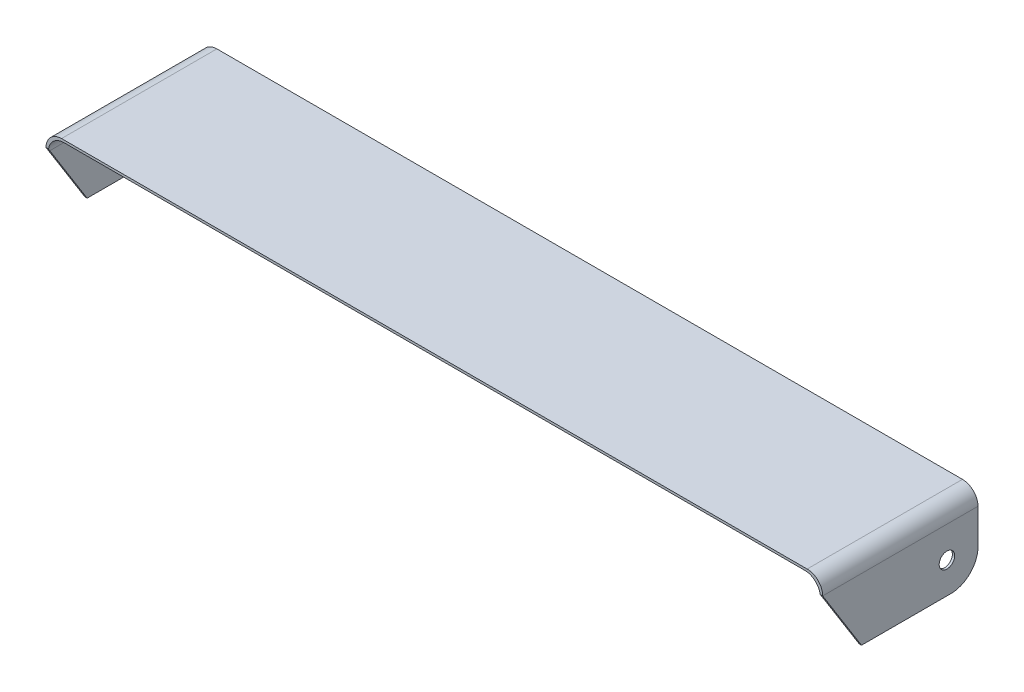
ISO-10303-21;
HEADER;
FILE_DESCRIPTION(('STEP AP214'),'2;1');
FILE_NAME('part.step','',(''),(''),'','','');
FILE_SCHEMA(('AUTOMOTIVE_DESIGN { 1 0 10303 214 1 1 1 1 }'));
ENDSEC;
DATA;
#1=APPLICATION_CONTEXT('core data for automotive mechanical design processes');
#2=APPLICATION_PROTOCOL_DEFINITION('international standard','automotive_design',2000,#1);
#3=PRODUCT_CONTEXT('',#1,'mechanical');
#4=PRODUCT('Part','Part','',(#3));
#5=PRODUCT_RELATED_PRODUCT_CATEGORY('part','',(#4));
#6=PRODUCT_DEFINITION_FORMATION('','',#4);
#7=PRODUCT_DEFINITION_CONTEXT('part definition',#1,'design');
#8=PRODUCT_DEFINITION('design','',#6,#7);
#9=PRODUCT_DEFINITION_SHAPE('','',#8);
#10=(LENGTH_UNIT() NAMED_UNIT(*) SI_UNIT(.MILLI.,.METRE.));
#11=(NAMED_UNIT(*) PLANE_ANGLE_UNIT() SI_UNIT($,.RADIAN.));
#12=(NAMED_UNIT(*) SI_UNIT($,.STERADIAN.) SOLID_ANGLE_UNIT());
#13=UNCERTAINTY_MEASURE_WITH_UNIT(LENGTH_MEASURE(1.E-05),#10,'distance_accuracy_value','');
#14=(GEOMETRIC_REPRESENTATION_CONTEXT(3) GLOBAL_UNCERTAINTY_ASSIGNED_CONTEXT((#13)) GLOBAL_UNIT_ASSIGNED_CONTEXT((#10,
#11,#12)) REPRESENTATION_CONTEXT('',''));
#15=CARTESIAN_POINT('',(0.,0.,0.));
#16=DIRECTION('',(0.,0.,1.));
#17=DIRECTION('',(1.,0.,0.));
#18=AXIS2_PLACEMENT_3D('',#15,#16,#17);
#19=CARTESIAN_POINT('',(0.,0.,100.));
#20=DIRECTION('',(0.,1.,0.));
#21=DIRECTION('',(0.,0.,1.));
#22=AXIS2_PLACEMENT_3D('',#19,#20,#21);
#23=PLANE('',#22);
#24=DIRECTION('',(0.,0.,-1.));
#25=VECTOR('',#24,1.);
#26=CARTESIAN_POINT('',(0.,0.,100.));
#27=LINE('',#26,#25);
#28=CARTESIAN_POINT('',(0.,0.,50.));
#29=VERTEX_POINT('',#28);
#30=CARTESIAN_POINT('',(0.,0.,-65.));
#31=VERTEX_POINT('',#30);
#32=EDGE_CURVE('E163',#29,#31,#27,.T.);
#33=ORIENTED_EDGE('',*,*,#32,.T.);
#34=DIRECTION('',(1.,0.,0.));
#35=VECTOR('',#34,1.);
#36=CARTESIAN_POINT('',(0.,0.,-65.));
#37=LINE('',#36,#35);
#38=CARTESIAN_POINT('',(3.,0.,-65.));
#39=VERTEX_POINT('',#38);
#40=EDGE_CURVE('E210',#31,#39,#37,.T.);
#41=ORIENTED_EDGE('',*,*,#40,.T.);
#42=DIRECTION('',(0.,0.,-1.));
#43=VECTOR('',#42,1.);
#44=CARTESIAN_POINT('',(3.,0.,100.));
#45=LINE('',#44,#43);
#46=CARTESIAN_POINT('',(3.,0.,50.));
#47=VERTEX_POINT('',#46);
#48=EDGE_CURVE('E166',#47,#39,#45,.T.);
#49=ORIENTED_EDGE('',*,*,#48,.F.);
#50=DIRECTION('',(1.,0.,0.));
#51=VECTOR('',#50,1.);
#52=CARTESIAN_POINT('',(0.,0.,50.));
#53=LINE('',#52,#51);
#54=EDGE_CURVE('E148',#29,#47,#53,.T.);
#55=ORIENTED_EDGE('',*,*,#54,.F.);
#56=EDGE_LOOP('',(#33,#41,#49,#55));
#57=FACE_BOUND('',#56,.T.);
#58=ADVANCED_FACE('F39',(#57),#23,.F.);
#59=CARTESIAN_POINT('',(3.,0.,100.));
#60=DIRECTION('',(-1.,0.,0.));
#61=DIRECTION('',(0.,0.,1.));
#62=AXIS2_PLACEMENT_3D('',#59,#60,#61);
#63=PLANE('',#62);
#64=CARTESIAN_POINT('',(3.,40.,-60.));
#65=DIRECTION('',(-1.,0.,0.));
#66=DIRECTION('',(0.,0.,1.));
#67=AXIS2_PLACEMENT_3D('',#64,#65,#66);
#68=CIRCLE('',#67,10.);
#69=CARTESIAN_POINT('',(3.,40.,-50.));
#70=VERTEX_POINT('',#69);
#71=EDGE_CURVE('E315',#70,#70,#68,.T.);
#72=ORIENTED_EDGE('',*,*,#71,.T.);
#73=EDGE_LOOP('',(#72));
#74=FACE_BOUND('',#73,.T.);
#75=ORIENTED_EDGE('',*,*,#48,.T.);
#76=CARTESIAN_POINT('',(3.,35.,-65.));
#77=DIRECTION('',(-1.,0.,0.));
#78=DIRECTION('',(0.,0.,1.));
#79=AXIS2_PLACEMENT_3D('',#76,#77,#78);
#80=CIRCLE('',#79,35.);
#81=CARTESIAN_POINT('',(3.,35.,-100.));
#82=VERTEX_POINT('',#81);
#83=EDGE_CURVE('E212',#39,#82,#80,.F.);
#84=ORIENTED_EDGE('',*,*,#83,.T.);
#85=DIRECTION('',(0.,1.,0.));
#86=VECTOR('',#85,1.);
#87=CARTESIAN_POINT('',(3.,0.,-100.));
#88=LINE('',#87,#86);
#89=CARTESIAN_POINT('',(3.,76.9999999999999,-100.));
#90=VERTEX_POINT('',#89);
#91=EDGE_CURVE('E286',#82,#90,#88,.T.);
#92=ORIENTED_EDGE('',*,*,#91,.T.);
#93=DIRECTION('',(0.,0.,-1.));
#94=VECTOR('',#93,1.);
#95=CARTESIAN_POINT('',(3.,76.9999999999999,100.));
#96=LINE('',#95,#94);
#97=CARTESIAN_POINT('',(3.,76.9999999999999,98.1249999999999));
#98=VERTEX_POINT('',#97);
#99=EDGE_CURVE('E204',#98,#90,#96,.T.);
#100=ORIENTED_EDGE('',*,*,#99,.F.);
#101=DIRECTION('',(0.,-0.847998304005088,-0.52999894000318));
#102=VECTOR('',#101,1.);
#103=CARTESIAN_POINT('',(3.,22.4719101123596,64.0449438202247));
#104=LINE('',#103,#102);
#105=EDGE_CURVE('E278',#98,#47,#104,.T.);
#106=ORIENTED_EDGE('',*,*,#105,.T.);
#107=EDGE_LOOP('',(#75,#84,#92,#100,#106));
#108=FACE_BOUND('',#107,.T.);
#109=ADVANCED_FACE('F300',(#74,#108),#63,.F.);
#110=CARTESIAN_POINT('',(23.,77.,100.));
#111=DIRECTION('',(0.,0.,-1.));
#112=DIRECTION('',(-1.,0.,0.));
#113=AXIS2_PLACEMENT_3D('',#110,#111,#112);
#114=CYLINDRICAL_SURFACE('',#113,20.);
#115=CARTESIAN_POINT('',(23.,77.,100.));
#116=DIRECTION('',(0.,0.,-1.));
#117=DIRECTION('',(1.,0.,0.));
#118=AXIS2_PLACEMENT_3D('',#115,#116,#117);
#119=CIRCLE('',#118,20.);
#120=CARTESIAN_POINT('',(3.22628006671481,80.,100.));
#121=VERTEX_POINT('',#120);
#122=CARTESIAN_POINT('',(23.0000000000001,97.,100.));
#123=VERTEX_POINT('',#122);
#124=EDGE_CURVE('E267',#121,#123,#119,.T.);
#125=ORIENTED_EDGE('',*,*,#124,.F.);
#126=CARTESIAN_POINT('',(23.,77.,98.125));
#127=DIRECTION('',(0.,0.52999894000318,-0.847998304005088));
#128=DIRECTION('',(0.,-0.847998304005088,-0.52999894000318));
#129=AXIS2_PLACEMENT_3D('',#126,#127,#128);
#130=ELLIPSE('',#129,23.5849528301415,20.);
#131=EDGE_CURVE('E298',#121,#98,#130,.F.);
#132=ORIENTED_EDGE('',*,*,#131,.T.);
#133=ORIENTED_EDGE('',*,*,#99,.T.);
#134=CARTESIAN_POINT('',(23.,77.,-100.));
#135=DIRECTION('',(0.,0.,-1.));
#136=DIRECTION('',(1.,0.,0.));
#137=AXIS2_PLACEMENT_3D('',#134,#135,#136);
#138=CIRCLE('',#137,20.);
#139=CARTESIAN_POINT('',(23.0000000000001,97.,-100.));
#140=VERTEX_POINT('',#139);
#141=EDGE_CURVE('E288',#90,#140,#138,.T.);
#142=ORIENTED_EDGE('',*,*,#141,.T.);
#143=DIRECTION('',(0.,0.,-1.));
#144=VECTOR('',#143,1.);
#145=CARTESIAN_POINT('',(23.0000000000001,97.,100.));
#146=LINE('',#145,#144);
#147=EDGE_CURVE('E201',#123,#140,#146,.T.);
#148=ORIENTED_EDGE('',*,*,#147,.F.);
#149=EDGE_LOOP('',(#125,#132,#133,#142,#148));
#150=FACE_BOUND('',#149,.T.);
#151=ADVANCED_FACE('F295',(#150),#114,.F.);
#152=CARTESIAN_POINT('',(23.0000000000001,97.,100.));
#153=DIRECTION('',(0.,1.,0.));
#154=DIRECTION('',(0.,0.,1.));
#155=AXIS2_PLACEMENT_3D('',#152,#153,#154);
#156=PLANE('',#155);
#157=DIRECTION('',(1.,0.,0.));
#158=VECTOR('',#157,1.);
#159=CARTESIAN_POINT('',(23.0000000000001,97.,-100.));
#160=LINE('',#159,#158);
#161=CARTESIAN_POINT('',(977.,97.,-100.));
#162=VERTEX_POINT('',#161);
#163=EDGE_CURVE('E256',#140,#162,#160,.T.);
#164=ORIENTED_EDGE('',*,*,#163,.T.);
#165=DIRECTION('',(0.,0.,-1.));
#166=VECTOR('',#165,1.);
#167=CARTESIAN_POINT('',(977.,97.,100.));
#168=LINE('',#167,#166);
#169=CARTESIAN_POINT('',(977.,97.,100.));
#170=VERTEX_POINT('',#169);
#171=EDGE_CURVE('E198',#170,#162,#168,.T.);
#172=ORIENTED_EDGE('',*,*,#171,.F.);
#173=DIRECTION('',(1.,0.,0.));
#174=VECTOR('',#173,1.);
#175=CARTESIAN_POINT('',(23.0000000000001,97.,100.));
#176=LINE('',#175,#174);
#177=EDGE_CURVE('E269',#123,#170,#176,.T.);
#178=ORIENTED_EDGE('',*,*,#177,.F.);
#179=ORIENTED_EDGE('',*,*,#147,.T.);
#180=EDGE_LOOP('',(#164,#172,#178,#179));
#181=FACE_BOUND('',#180,.T.);
#182=ADVANCED_FACE('F290',(#181),#156,.F.);
#183=CARTESIAN_POINT('',(977.,77.,100.));
#184=DIRECTION('',(0.,0.,-1.));
#185=DIRECTION('',(-1.,0.,0.));
#186=AXIS2_PLACEMENT_3D('',#183,#184,#185);
#187=CYLINDRICAL_SURFACE('',#186,20.);
#188=DIRECTION('',(0.,0.,-1.));
#189=VECTOR('',#188,1.);
#190=CARTESIAN_POINT('',(997.,76.9999999999999,100.));
#191=LINE('',#190,#189);
#192=CARTESIAN_POINT('',(997.,76.9999999999999,98.1249999999999));
#193=VERTEX_POINT('',#192);
#194=CARTESIAN_POINT('',(997.,76.9999999999999,-100.));
#195=VERTEX_POINT('',#194);
#196=EDGE_CURVE('E196',#193,#195,#191,.T.);
#197=ORIENTED_EDGE('',*,*,#196,.F.);
#198=CARTESIAN_POINT('',(977.,77.,98.125));
#199=DIRECTION('',(0.,0.52999894000318,-0.847998304005088));
#200=DIRECTION('',(0.,-0.847998304005088,-0.52999894000318));
#201=AXIS2_PLACEMENT_3D('',#198,#199,#200);
#202=ELLIPSE('',#201,23.5849528301415,20.);
#203=CARTESIAN_POINT('',(996.773719933285,80.,100.));
#204=VERTEX_POINT('',#203);
#205=EDGE_CURVE('E245',#193,#204,#202,.F.);
#206=ORIENTED_EDGE('',*,*,#205,.T.);
#207=CARTESIAN_POINT('',(977.,77.,100.));
#208=DIRECTION('',(0.,0.,-1.));
#209=DIRECTION('',(1.,0.,0.));
#210=AXIS2_PLACEMENT_3D('',#207,#208,#209);
#211=CIRCLE('',#210,20.);
#212=EDGE_CURVE('E275',#170,#204,#211,.T.);
#213=ORIENTED_EDGE('',*,*,#212,.F.);
#214=ORIENTED_EDGE('',*,*,#171,.T.);
#215=CARTESIAN_POINT('',(977.,77.,-100.));
#216=DIRECTION('',(0.,0.,-1.));
#217=DIRECTION('',(1.,0.,0.));
#218=AXIS2_PLACEMENT_3D('',#215,#216,#217);
#219=CIRCLE('',#218,20.);
#220=EDGE_CURVE('E253',#162,#195,#219,.T.);
#221=ORIENTED_EDGE('',*,*,#220,.T.);
#222=EDGE_LOOP('',(#197,#206,#213,#214,#221));
#223=FACE_BOUND('',#222,.T.);
#224=ADVANCED_FACE('F249',(#223),#187,.F.);
#225=CARTESIAN_POINT('',(997.,76.9999999999999,100.));
#226=DIRECTION('',(1.,0.,0.));
#227=DIRECTION('',(0.,0.,-1.));
#228=AXIS2_PLACEMENT_3D('',#225,#226,#227);
#229=PLANE('',#228);
#230=CARTESIAN_POINT('',(997.,40.,-60.));
#231=DIRECTION('',(1.,0.,0.));
#232=DIRECTION('',(0.,0.,-1.));
#233=AXIS2_PLACEMENT_3D('',#230,#231,#232);
#234=CIRCLE('',#233,10.);
#235=CARTESIAN_POINT('',(997.,40.,-70.));
#236=VERTEX_POINT('',#235);
#237=EDGE_CURVE('E318',#236,#236,#234,.T.);
#238=ORIENTED_EDGE('',*,*,#237,.T.);
#239=EDGE_LOOP('',(#238));
#240=FACE_BOUND('',#239,.T.);
#241=DIRECTION('',(0.,-1.,0.));
#242=VECTOR('',#241,1.);
#243=CARTESIAN_POINT('',(997.,76.9999999999999,-100.));
#244=LINE('',#243,#242);
#245=CARTESIAN_POINT('',(997.,35.,-100.));
#246=VERTEX_POINT('',#245);
#247=EDGE_CURVE('E234',#195,#246,#244,.T.);
#248=ORIENTED_EDGE('',*,*,#247,.T.);
#249=CARTESIAN_POINT('',(997.,35.,-65.));
#250=DIRECTION('',(1.,0.,0.));
#251=DIRECTION('',(0.,0.,-1.));
#252=AXIS2_PLACEMENT_3D('',#249,#250,#251);
#253=CIRCLE('',#252,35.);
#254=CARTESIAN_POINT('',(997.,0.,-65.));
#255=VERTEX_POINT('',#254);
#256=EDGE_CURVE('E11',#246,#255,#253,.F.);
#257=ORIENTED_EDGE('',*,*,#256,.T.);
#258=DIRECTION('',(0.,0.,-1.));
#259=VECTOR('',#258,1.);
#260=CARTESIAN_POINT('',(997.,0.,100.));
#261=LINE('',#260,#259);
#262=CARTESIAN_POINT('',(997.,0.,50.));
#263=VERTEX_POINT('',#262);
#264=EDGE_CURVE('E194',#263,#255,#261,.T.);
#265=ORIENTED_EDGE('',*,*,#264,.F.);
#266=DIRECTION('',(0.,0.847998304005088,0.52999894000318));
#267=VECTOR('',#266,1.);
#268=CARTESIAN_POINT('',(997.,77.8426966292134,98.6516853932584));
#269=LINE('',#268,#267);
#270=EDGE_CURVE('E241',#263,#193,#269,.T.);
#271=ORIENTED_EDGE('',*,*,#270,.T.);
#272=ORIENTED_EDGE('',*,*,#196,.T.);
#273=EDGE_LOOP('',(#248,#257,#265,#271,#272));
#274=FACE_BOUND('',#273,.T.);
#275=ADVANCED_FACE('F240',(#240,#274),#229,.F.);
#276=CARTESIAN_POINT('',(997.,0.,100.));
#277=DIRECTION('',(0.,1.,0.));
#278=DIRECTION('',(0.,0.,1.));
#279=AXIS2_PLACEMENT_3D('',#276,#277,#278);
#280=PLANE('',#279);
#281=ORIENTED_EDGE('',*,*,#264,.T.);
#282=DIRECTION('',(1.,0.,0.));
#283=VECTOR('',#282,1.);
#284=CARTESIAN_POINT('',(997.,0.,-65.));
#285=LINE('',#284,#283);
#286=CARTESIAN_POINT('',(1000.,0.,-65.));
#287=VERTEX_POINT('',#286);
#288=EDGE_CURVE('E219',#255,#287,#285,.T.);
#289=ORIENTED_EDGE('',*,*,#288,.T.);
#290=DIRECTION('',(0.,0.,-1.));
#291=VECTOR('',#290,1.);
#292=CARTESIAN_POINT('',(1000.,0.,100.));
#293=LINE('',#292,#291);
#294=CARTESIAN_POINT('',(1000.,0.,50.));
#295=VERTEX_POINT('',#294);
#296=EDGE_CURVE('E191',#295,#287,#293,.T.);
#297=ORIENTED_EDGE('',*,*,#296,.F.);
#298=EDGE_CURVE('E156',#263,#295,#53,.T.);
#299=ORIENTED_EDGE('',*,*,#298,.F.);
#300=EDGE_LOOP('',(#281,#289,#297,#299));
#301=FACE_BOUND('',#300,.T.);
#302=ADVANCED_FACE('F237',(#301),#280,.F.);
#303=CARTESIAN_POINT('',(1000.,79.9999999999999,100.));
#304=DIRECTION('',(-1.,0.,0.));
#305=DIRECTION('',(0.,0.,1.));
#306=AXIS2_PLACEMENT_3D('',#303,#304,#305);
#307=PLANE('',#306);
#308=CARTESIAN_POINT('',(1000.,40.,-60.));
#309=DIRECTION('',(1.,0.,0.));
#310=DIRECTION('',(0.,0.,-1.));
#311=AXIS2_PLACEMENT_3D('',#308,#309,#310);
#312=CIRCLE('',#311,10.);
#313=CARTESIAN_POINT('',(1000.,40.,-70.));
#314=VERTEX_POINT('',#313);
#315=EDGE_CURVE('E326',#314,#314,#312,.T.);
#316=ORIENTED_EDGE('',*,*,#315,.F.);
#317=EDGE_LOOP('',(#316));
#318=FACE_BOUND('',#317,.T.);
#319=ORIENTED_EDGE('',*,*,#296,.T.);
#320=CARTESIAN_POINT('',(1000.,35.,-65.));
#321=DIRECTION('',(-1.,0.,0.));
#322=DIRECTION('',(0.,0.,1.));
#323=AXIS2_PLACEMENT_3D('',#320,#321,#322);
#324=CIRCLE('',#323,35.);
#325=CARTESIAN_POINT('',(1000.,35.,-100.));
#326=VERTEX_POINT('',#325);
#327=EDGE_CURVE('E47',#287,#326,#324,.F.);
#328=ORIENTED_EDGE('',*,*,#327,.T.);
#329=DIRECTION('',(0.,1.,0.));
#330=VECTOR('',#329,1.);
#331=CARTESIAN_POINT('',(1000.,79.9999999999999,-100.));
#332=LINE('',#331,#330);
#333=CARTESIAN_POINT('',(1000.,79.9999999999998,-100.));
#334=VERTEX_POINT('',#333);
#335=EDGE_CURVE('E224',#326,#334,#332,.T.);
#336=ORIENTED_EDGE('',*,*,#335,.T.);
#337=DIRECTION('',(0.,0.,-1.));
#338=VECTOR('',#337,1.);
#339=CARTESIAN_POINT('',(1000.,79.9999999999998,100.));
#340=LINE('',#339,#338);
#341=CARTESIAN_POINT('',(1000.,79.9999999999998,100.));
#342=VERTEX_POINT('',#341);
#343=EDGE_CURVE('E188',#342,#334,#340,.T.);
#344=ORIENTED_EDGE('',*,*,#343,.F.);
#345=DIRECTION('',(0.,0.847998304005088,0.52999894000318));
#346=VECTOR('',#345,1.);
#347=CARTESIAN_POINT('',(1000.,0.,50.));
#348=LINE('',#347,#346);
#349=EDGE_CURVE('E157',#295,#342,#348,.T.);
#350=ORIENTED_EDGE('',*,*,#349,.F.);
#351=EDGE_LOOP('',(#319,#328,#336,#344,#350));
#352=FACE_BOUND('',#351,.T.);
#353=ADVANCED_FACE('F222',(#318,#352),#307,.F.);
#354=CARTESIAN_POINT('',(980.,80.,100.));
#355=DIRECTION('',(0.,0.,-1.));
#356=DIRECTION('',(-1.,0.,0.));
#357=AXIS2_PLACEMENT_3D('',#354,#355,#356);
#358=CYLINDRICAL_SURFACE('',#357,20.);
#359=CARTESIAN_POINT('',(980.,80.,-100.));
#360=DIRECTION('',(0.,0.,1.));
#361=DIRECTION('',(1.,0.,0.));
#362=AXIS2_PLACEMENT_3D('',#359,#360,#361);
#363=CIRCLE('',#362,20.);
#364=CARTESIAN_POINT('',(980.,100.,-100.));
#365=VERTEX_POINT('',#364);
#366=EDGE_CURVE('E233',#334,#365,#363,.T.);
#367=ORIENTED_EDGE('',*,*,#366,.T.);
#368=DIRECTION('',(0.,0.,-1.));
#369=VECTOR('',#368,1.);
#370=CARTESIAN_POINT('',(980.,100.,100.));
#371=LINE('',#370,#369);
#372=CARTESIAN_POINT('',(980.,100.,100.));
#373=VERTEX_POINT('',#372);
#374=EDGE_CURVE('E185',#373,#365,#371,.T.);
#375=ORIENTED_EDGE('',*,*,#374,.F.);
#376=CARTESIAN_POINT('',(980.,80.,100.));
#377=DIRECTION('',(0.,0.,1.));
#378=DIRECTION('',(1.,0.,0.));
#379=AXIS2_PLACEMENT_3D('',#376,#377,#378);
#380=CIRCLE('',#379,20.);
#381=EDGE_CURVE('E282',#342,#373,#380,.T.);
#382=ORIENTED_EDGE('',*,*,#381,.F.);
#383=ORIENTED_EDGE('',*,*,#343,.T.);
#384=EDGE_LOOP('',(#367,#375,#382,#383));
#385=FACE_BOUND('',#384,.T.);
#386=ADVANCED_FACE('F314',(#385),#358,.T.);
#387=CARTESIAN_POINT('',(20.0000000000001,100.,100.));
#388=DIRECTION('',(0.,-1.,0.));
#389=DIRECTION('',(0.,0.,-1.));
#390=AXIS2_PLACEMENT_3D('',#387,#388,#389);
#391=PLANE('',#390);
#392=DIRECTION('',(-1.,0.,0.));
#393=VECTOR('',#392,1.);
#394=CARTESIAN_POINT('',(20.0000000000001,100.,-100.));
#395=LINE('',#394,#393);
#396=CARTESIAN_POINT('',(20.0000000000001,100.,-100.));
#397=VERTEX_POINT('',#396);
#398=EDGE_CURVE('E262',#365,#397,#395,.T.);
#399=ORIENTED_EDGE('',*,*,#398,.T.);
#400=DIRECTION('',(0.,0.,-1.));
#401=VECTOR('',#400,1.);
#402=CARTESIAN_POINT('',(20.0000000000001,100.,100.));
#403=LINE('',#402,#401);
#404=CARTESIAN_POINT('',(20.0000000000001,100.,100.));
#405=VERTEX_POINT('',#404);
#406=EDGE_CURVE('E175',#405,#397,#403,.T.);
#407=ORIENTED_EDGE('',*,*,#406,.F.);
#408=DIRECTION('',(-1.,0.,0.));
#409=VECTOR('',#408,1.);
#410=CARTESIAN_POINT('',(20.0000000000001,100.,100.));
#411=LINE('',#410,#409);
#412=EDGE_CURVE('E177',#373,#405,#411,.T.);
#413=ORIENTED_EDGE('',*,*,#412,.F.);
#414=ORIENTED_EDGE('',*,*,#374,.T.);
#415=EDGE_LOOP('',(#399,#407,#413,#414));
#416=FACE_BOUND('',#415,.T.);
#417=ADVANCED_FACE('F305',(#416),#391,.F.);
#418=CARTESIAN_POINT('',(20.,80.,100.));
#419=DIRECTION('',(0.,0.,-1.));
#420=DIRECTION('',(-1.,0.,0.));
#421=AXIS2_PLACEMENT_3D('',#418,#419,#420);
#422=CYLINDRICAL_SURFACE('',#421,20.);
#423=CARTESIAN_POINT('',(20.,80.,-100.));
#424=DIRECTION('',(0.,0.,1.));
#425=DIRECTION('',(1.,0.,0.));
#426=AXIS2_PLACEMENT_3D('',#423,#424,#425);
#427=CIRCLE('',#426,20.);
#428=CARTESIAN_POINT('',(0.,79.9999999999999,-100.));
#429=VERTEX_POINT('',#428);
#430=EDGE_CURVE('E263',#397,#429,#427,.T.);
#431=ORIENTED_EDGE('',*,*,#430,.T.);
#432=DIRECTION('',(0.,0.,-1.));
#433=VECTOR('',#432,1.);
#434=CARTESIAN_POINT('',(0.,79.9999999999999,100.));
#435=LINE('',#434,#433);
#436=CARTESIAN_POINT('',(0.,80.,100.));
#437=VERTEX_POINT('',#436);
#438=EDGE_CURVE('E172',#437,#429,#435,.T.);
#439=ORIENTED_EDGE('',*,*,#438,.F.);
#440=CARTESIAN_POINT('',(20.,80.,100.));
#441=DIRECTION('',(0.,0.,1.));
#442=DIRECTION('',(1.,0.,0.));
#443=AXIS2_PLACEMENT_3D('',#440,#441,#442);
#444=CIRCLE('',#443,20.);
#445=EDGE_CURVE('E173',#405,#437,#444,.T.);
#446=ORIENTED_EDGE('',*,*,#445,.F.);
#447=ORIENTED_EDGE('',*,*,#406,.T.);
#448=EDGE_LOOP('',(#431,#439,#446,#447));
#449=FACE_BOUND('',#448,.T.);
#450=ADVANCED_FACE('F309',(#449),#422,.T.);
#451=CARTESIAN_POINT('',(0.,0.,100.));
#452=DIRECTION('',(1.,0.,0.));
#453=DIRECTION('',(0.,0.,-1.));
#454=AXIS2_PLACEMENT_3D('',#451,#452,#453);
#455=PLANE('',#454);
#456=CARTESIAN_POINT('',(0.,40.,-60.));
#457=DIRECTION('',(1.,0.,0.));
#458=DIRECTION('',(0.,0.,-1.));
#459=AXIS2_PLACEMENT_3D('',#456,#457,#458);
#460=CIRCLE('',#459,10.);
#461=CARTESIAN_POINT('',(0.,40.,-70.));
#462=VERTEX_POINT('',#461);
#463=EDGE_CURVE('E325',#462,#462,#460,.T.);
#464=ORIENTED_EDGE('',*,*,#463,.T.);
#465=EDGE_LOOP('',(#464));
#466=FACE_BOUND('',#465,.T.);
#467=DIRECTION('',(0.,-1.,0.));
#468=VECTOR('',#467,1.);
#469=CARTESIAN_POINT('',(0.,0.,-100.));
#470=LINE('',#469,#468);
#471=CARTESIAN_POINT('',(0.,35.,-100.));
#472=VERTEX_POINT('',#471);
#473=EDGE_CURVE('E180',#429,#472,#470,.T.);
#474=ORIENTED_EDGE('',*,*,#473,.T.);
#475=CARTESIAN_POINT('',(0.,35.,-65.));
#476=DIRECTION('',(1.,0.,0.));
#477=DIRECTION('',(0.,0.,-1.));
#478=AXIS2_PLACEMENT_3D('',#475,#476,#477);
#479=CIRCLE('',#478,35.);
#480=EDGE_CURVE('E171',#472,#31,#479,.F.);
#481=ORIENTED_EDGE('',*,*,#480,.T.);
#482=ORIENTED_EDGE('',*,*,#32,.F.);
#483=DIRECTION('',(0.,0.847998304005088,0.52999894000318));
#484=VECTOR('',#483,1.);
#485=CARTESIAN_POINT('',(0.,0.,50.));
#486=LINE('',#485,#484);
#487=EDGE_CURVE('E145',#29,#437,#486,.T.);
#488=ORIENTED_EDGE('',*,*,#487,.T.);
#489=ORIENTED_EDGE('',*,*,#438,.T.);
#490=EDGE_LOOP('',(#474,#481,#482,#488,#489));
#491=FACE_BOUND('',#490,.T.);
#492=ADVANCED_FACE('F169',(#466,#491),#455,.F.);
#493=CARTESIAN_POINT('',(23.,77.,100.));
#494=DIRECTION('',(0.,0.,1.));
#495=DIRECTION('',(1.,0.,0.));
#496=AXIS2_PLACEMENT_3D('',#493,#494,#495);
#497=PLANE('',#496);
#498=DIRECTION('',(-1.,0.,0.));
#499=VECTOR('',#498,1.);
#500=CARTESIAN_POINT('',(23.,80.,100.));
#501=LINE('',#500,#499);
#502=EDGE_CURVE('E208',#342,#204,#501,.T.);
#503=ORIENTED_EDGE('',*,*,#502,.F.);
#504=ORIENTED_EDGE('',*,*,#381,.T.);
#505=ORIENTED_EDGE('',*,*,#412,.T.);
#506=ORIENTED_EDGE('',*,*,#445,.T.);
#507=DIRECTION('',(1.,0.,0.));
#508=VECTOR('',#507,1.);
#509=CARTESIAN_POINT('',(0.,80.,100.));
#510=LINE('',#509,#508);
#511=EDGE_CURVE('E151',#437,#121,#510,.T.);
#512=ORIENTED_EDGE('',*,*,#511,.T.);
#513=ORIENTED_EDGE('',*,*,#124,.T.);
#514=ORIENTED_EDGE('',*,*,#177,.T.);
#515=ORIENTED_EDGE('',*,*,#212,.T.);
#516=EDGE_LOOP('',(#503,#504,#505,#506,#512,#513,#514,#515));
#517=FACE_BOUND('',#516,.T.);
#518=ADVANCED_FACE('F311',(#517),#497,.T.);
#519=CARTESIAN_POINT('',(23.,77.,-100.));
#520=DIRECTION('',(0.,0.,1.));
#521=DIRECTION('',(1.,0.,0.));
#522=AXIS2_PLACEMENT_3D('',#519,#520,#521);
#523=PLANE('',#522);
#524=ORIENTED_EDGE('',*,*,#91,.F.);
#525=DIRECTION('',(1.,0.,0.));
#526=VECTOR('',#525,1.);
#527=CARTESIAN_POINT('',(23.,35.,-100.));
#528=LINE('',#527,#526);
#529=EDGE_CURVE('E216',#82,#472,#528,.F.);
#530=ORIENTED_EDGE('',*,*,#529,.T.);
#531=ORIENTED_EDGE('',*,*,#473,.F.);
#532=ORIENTED_EDGE('',*,*,#430,.F.);
#533=ORIENTED_EDGE('',*,*,#398,.F.);
#534=ORIENTED_EDGE('',*,*,#366,.F.);
#535=ORIENTED_EDGE('',*,*,#335,.F.);
#536=DIRECTION('',(1.,0.,0.));
#537=VECTOR('',#536,1.);
#538=CARTESIAN_POINT('',(23.,35.,-100.));
#539=LINE('',#538,#537);
#540=EDGE_CURVE('E214',#326,#246,#539,.F.);
#541=ORIENTED_EDGE('',*,*,#540,.T.);
#542=ORIENTED_EDGE('',*,*,#247,.F.);
#543=ORIENTED_EDGE('',*,*,#220,.F.);
#544=ORIENTED_EDGE('',*,*,#163,.F.);
#545=ORIENTED_EDGE('',*,*,#141,.F.);
#546=EDGE_LOOP('',(#524,#530,#531,#532,#533,#534,#535,#541,#542,#543,#544,#545));
#547=FACE_BOUND('',#546,.T.);
#548=ADVANCED_FACE('F230',(#547),#523,.F.);
#549=CARTESIAN_POINT('',(0.,0.,50.));
#550=DIRECTION('',(0.,0.52999894000318,-0.847998304005088));
#551=DIRECTION('',(0.,0.847998304005088,0.52999894000318));
#552=AXIS2_PLACEMENT_3D('',#549,#550,#551);
#553=PLANE('',#552);
#554=ORIENTED_EDGE('',*,*,#131,.F.);
#555=ORIENTED_EDGE('',*,*,#511,.F.);
#556=ORIENTED_EDGE('',*,*,#487,.F.);
#557=ORIENTED_EDGE('',*,*,#54,.T.);
#558=ORIENTED_EDGE('',*,*,#105,.F.);
#559=EDGE_LOOP('',(#554,#555,#556,#557,#558));
#560=FACE_BOUND('',#559,.T.);
#561=ADVANCED_FACE('F147',(#560),#553,.F.);
#562=ORIENTED_EDGE('',*,*,#270,.F.);
#563=ORIENTED_EDGE('',*,*,#298,.T.);
#564=ORIENTED_EDGE('',*,*,#349,.T.);
#565=ORIENTED_EDGE('',*,*,#502,.T.);
#566=ORIENTED_EDGE('',*,*,#205,.F.);
#567=EDGE_LOOP('',(#562,#563,#564,#565,#566));
#568=FACE_BOUND('',#567,.T.);
#569=ADVANCED_FACE('F337',(#568),#553,.F.);
#570=CARTESIAN_POINT('',(0.,40.,-60.));
#571=DIRECTION('',(1.,0.,0.));
#572=DIRECTION('',(0.,0.,-1.));
#573=AXIS2_PLACEMENT_3D('',#570,#571,#572);
#574=CYLINDRICAL_SURFACE('',#573,10.);
#575=ORIENTED_EDGE('',*,*,#463,.F.);
#576=EDGE_LOOP('',(#575));
#577=FACE_BOUND('',#576,.T.);
#578=ORIENTED_EDGE('',*,*,#71,.F.);
#579=EDGE_LOOP('',(#578));
#580=FACE_BOUND('',#579,.T.);
#581=ADVANCED_FACE('F333',(#577,#580),#574,.F.);
#582=ORIENTED_EDGE('',*,*,#315,.T.);
#583=EDGE_LOOP('',(#582));
#584=FACE_BOUND('',#583,.T.);
#585=ORIENTED_EDGE('',*,*,#237,.F.);
#586=EDGE_LOOP('',(#585));
#587=FACE_BOUND('',#586,.T.);
#588=ADVANCED_FACE('F336',(#584,#587),#574,.F.);
#589=CARTESIAN_POINT('',(0.,35.,-65.));
#590=DIRECTION('',(1.,0.,0.));
#591=DIRECTION('',(0.,0.,-1.));
#592=AXIS2_PLACEMENT_3D('',#589,#590,#591);
#593=CYLINDRICAL_SURFACE('',#592,35.);
#594=ORIENTED_EDGE('',*,*,#480,.F.);
#595=ORIENTED_EDGE('',*,*,#529,.F.);
#596=ORIENTED_EDGE('',*,*,#83,.F.);
#597=ORIENTED_EDGE('',*,*,#40,.F.);
#598=EDGE_LOOP('',(#594,#595,#596,#597));
#599=FACE_BOUND('',#598,.T.);
#600=ADVANCED_FACE('F302',(#599),#593,.T.);
#601=CARTESIAN_POINT('',(997.,35.,-65.));
#602=DIRECTION('',(1.,0.,0.));
#603=DIRECTION('',(0.,0.,-1.));
#604=AXIS2_PLACEMENT_3D('',#601,#602,#603);
#605=CYLINDRICAL_SURFACE('',#604,35.);
#606=ORIENTED_EDGE('',*,*,#256,.F.);
#607=ORIENTED_EDGE('',*,*,#540,.F.);
#608=ORIENTED_EDGE('',*,*,#327,.F.);
#609=ORIENTED_EDGE('',*,*,#288,.F.);
#610=EDGE_LOOP('',(#606,#607,#608,#609));
#611=FACE_BOUND('',#610,.T.);
#612=ADVANCED_FACE('F41',(#611),#605,.T.);
#613=CLOSED_SHELL('',(#58,#109,#151,#182,#224,#275,#302,#353,#386,#417,#450,#492,#518,#548,#561,
#569,#581,#588,#600,#612));
#614=MANIFOLD_SOLID_BREP('B2',#613);
#615=ADVANCED_BREP_SHAPE_REPRESENTATION('',(#18,#614),#14);
#616=SHAPE_DEFINITION_REPRESENTATION(#9,#615);
ENDSEC;
END-ISO-10303-21;
